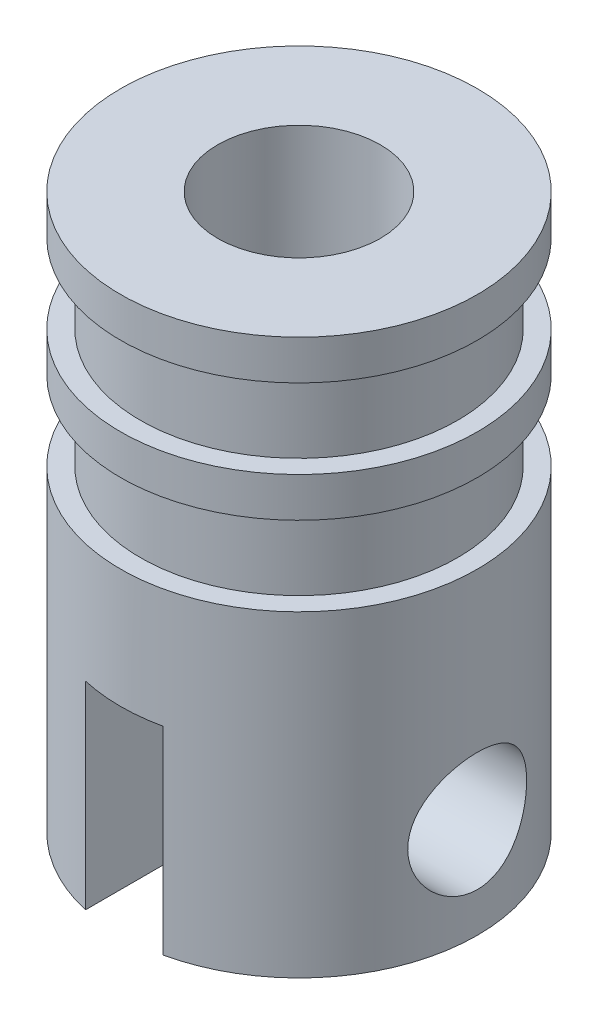
ISO-10303-21;
HEADER;
FILE_DESCRIPTION(('STEP AP214'),'2;1');
FILE_NAME('part.step','',(''),(''),'','','');
FILE_SCHEMA(('AUTOMOTIVE_DESIGN { 1 0 10303 214 1 1 1 1 }'));
ENDSEC;
DATA;
#1=APPLICATION_CONTEXT('core data for automotive mechanical design processes');
#2=APPLICATION_PROTOCOL_DEFINITION('international standard','automotive_design',2000,#1);
#3=PRODUCT_CONTEXT('',#1,'mechanical');
#4=PRODUCT('Part','Part','',(#3));
#5=PRODUCT_RELATED_PRODUCT_CATEGORY('part','',(#4));
#6=PRODUCT_DEFINITION_FORMATION('','',#4);
#7=PRODUCT_DEFINITION_CONTEXT('part definition',#1,'design');
#8=PRODUCT_DEFINITION('design','',#6,#7);
#9=PRODUCT_DEFINITION_SHAPE('','',#8);
#10=(LENGTH_UNIT() NAMED_UNIT(*) SI_UNIT(.MILLI.,.METRE.));
#11=(NAMED_UNIT(*) PLANE_ANGLE_UNIT() SI_UNIT($,.RADIAN.));
#12=(NAMED_UNIT(*) SI_UNIT($,.STERADIAN.) SOLID_ANGLE_UNIT());
#13=UNCERTAINTY_MEASURE_WITH_UNIT(LENGTH_MEASURE(1.E-05),#10,'distance_accuracy_value','');
#14=(GEOMETRIC_REPRESENTATION_CONTEXT(3) GLOBAL_UNCERTAINTY_ASSIGNED_CONTEXT((#13)) GLOBAL_UNIT_ASSIGNED_CONTEXT((#10,
#11,#12)) REPRESENTATION_CONTEXT('',''));
#15=CARTESIAN_POINT('',(0.,0.,0.));
#16=DIRECTION('',(0.,0.,1.));
#17=DIRECTION('',(1.,0.,0.));
#18=AXIS2_PLACEMENT_3D('',#15,#16,#17);
#19=CARTESIAN_POINT('',(-0.0120862167212276,-8.34923280183636,-1.91380127253106E-05));
#20=DIRECTION('',(0.,-1.,0.));
#21=DIRECTION('',(0.,0.,-1.));
#22=AXIS2_PLACEMENT_3D('',#19,#20,#21);
#23=PLANE('',#22);
#24=CARTESIAN_POINT('',(-0.0120862167212276,-8.34923280183638,-1.91380127253106E-05));
#25=DIRECTION('',(0.,1.,0.));
#26=DIRECTION('',(0.,0.,1.));
#27=AXIS2_PLACEMENT_3D('',#24,#25,#26);
#28=CIRCLE('',#27,14.35);
#29=CARTESIAN_POINT('',(-7.01208621672123,-8.34923280183636,12.5268519797086));
#30=VERTEX_POINT('',#29);
#31=CARTESIAN_POINT('',(6.75846371262122,-8.34923280183638,12.6523384942344));
#32=VERTEX_POINT('',#31);
#33=EDGE_CURVE('E113',#30,#32,#28,.T.);
#34=ORIENTED_EDGE('',*,*,#33,.T.);
#35=DIRECTION('',(0.,0.,1.));
#36=VECTOR('',#35,1.);
#37=CARTESIAN_POINT('',(6.75846371262122,-8.34923280183636,-31.5000191380127));
#38=LINE('',#37,#36);
#39=CARTESIAN_POINT('',(6.75846371262122,-8.34923280183636,30.7637526342242));
#40=VERTEX_POINT('',#39);
#41=EDGE_CURVE('E121',#32,#40,#38,.T.);
#42=ORIENTED_EDGE('',*,*,#41,.T.);
#43=CARTESIAN_POINT('',(-0.0120862167212276,-8.34923280183636,-1.91380127253106E-05));
#44=DIRECTION('',(0.,-1.,0.));
#45=DIRECTION('',(0.,0.,-1.));
#46=AXIS2_PLACEMENT_3D('',#43,#44,#45);
#47=CIRCLE('',#46,31.5);
#48=CARTESIAN_POINT('',(-7.01208621672123,-8.34923280183636,30.7123562178597));
#49=VERTEX_POINT('',#48);
#50=EDGE_CURVE('E11',#40,#49,#47,.T.);
#51=ORIENTED_EDGE('',*,*,#50,.T.);
#52=DIRECTION('',(0.,0.,-1.));
#53=VECTOR('',#52,1.);
#54=CARTESIAN_POINT('',(-7.01208621672123,-8.34923280183636,31.4999808619873));
#55=LINE('',#54,#53);
#56=EDGE_CURVE('E123',#49,#30,#55,.T.);
#57=ORIENTED_EDGE('',*,*,#56,.T.);
#58=EDGE_LOOP('',(#34,#42,#51,#57));
#59=FACE_BOUND('',#58,.T.);
#60=ADVANCED_FACE('F43',(#59),#23,.T.);
#61=CARTESIAN_POINT('',(-31.5120862167212,-43.3492328018364,-1.91380127253106E-05));
#62=DIRECTION('',(0.,1.,0.));
#63=DIRECTION('',(0.,0.,1.));
#64=AXIS2_PLACEMENT_3D('',#61,#62,#63);
#65=PLANE('',#64);
#66=CARTESIAN_POINT('',(-0.0120862167212276,-43.3492328018364,-1.91380127253106E-05));
#67=DIRECTION('',(0.,-1.,0.));
#68=DIRECTION('',(0.,0.,-1.));
#69=AXIS2_PLACEMENT_3D('',#66,#67,#68);
#70=CIRCLE('',#69,31.5);
#71=CARTESIAN_POINT('',(6.75846371262122,-43.3492328018364,-30.7637909102496));
#72=VERTEX_POINT('',#71);
#73=CARTESIAN_POINT('',(6.75846371262122,-43.3492328018364,30.7637526342242));
#74=VERTEX_POINT('',#73);
#75=EDGE_CURVE('E154',#72,#74,#70,.T.);
#76=ORIENTED_EDGE('',*,*,#75,.T.);
#77=DIRECTION('',(0.,0.,-1.));
#78=VECTOR('',#77,1.);
#79=CARTESIAN_POINT('',(6.75846371262122,-43.3492328018364,-1.91380127253106E-05));
#80=LINE('',#79,#78);
#81=EDGE_CURVE('E194',#74,#72,#80,.T.);
#82=ORIENTED_EDGE('',*,*,#81,.T.);
#83=EDGE_LOOP('',(#76,#82));
#84=FACE_BOUND('',#83,.T.);
#85=ADVANCED_FACE('F210',(#84),#65,.F.);
#86=CARTESIAN_POINT('',(-0.0120862167212276,54.6507671981636,-1.91380127253106E-05));
#87=DIRECTION('',(0.,-1.,0.));
#88=DIRECTION('',(0.,0.,-1.));
#89=AXIS2_PLACEMENT_3D('',#86,#87,#88);
#90=PLANE('',#89);
#91=CARTESIAN_POINT('',(-0.0120862167212276,54.6507671981636,-1.91380127253106E-05));
#92=DIRECTION('',(0.,1.,0.));
#93=DIRECTION('',(0.,0.,1.));
#94=AXIS2_PLACEMENT_3D('',#91,#92,#93);
#95=CIRCLE('',#94,14.35);
#96=CARTESIAN_POINT('',(-0.0120862167212276,54.6507671981636,14.3499808619873));
#97=VERTEX_POINT('',#96);
#98=EDGE_CURVE('E125',#97,#97,#95,.T.);
#99=ORIENTED_EDGE('',*,*,#98,.F.);
#100=EDGE_LOOP('',(#99));
#101=FACE_BOUND('',#100,.T.);
#102=CARTESIAN_POINT('',(-0.0120862167212276,54.6507671981636,-1.91380127253106E-05));
#103=DIRECTION('',(0.,-1.,0.));
#104=DIRECTION('',(0.,0.,-1.));
#105=AXIS2_PLACEMENT_3D('',#102,#103,#104);
#106=CIRCLE('',#105,31.5);
#107=CARTESIAN_POINT('',(-0.0120862167212276,54.6507671981636,-31.5000191380127));
#108=VERTEX_POINT('',#107);
#109=EDGE_CURVE('E187',#108,#108,#106,.T.);
#110=ORIENTED_EDGE('',*,*,#109,.F.);
#111=EDGE_LOOP('',(#110));
#112=FACE_BOUND('',#111,.T.);
#113=ADVANCED_FACE('F45',(#101,#112),#90,.F.);
#114=CARTESIAN_POINT('',(-0.0120862167212276,-43.3492328018364,-1.91380127253106E-05));
#115=DIRECTION('',(0.,-1.,0.));
#116=DIRECTION('',(0.,0.,-1.));
#117=AXIS2_PLACEMENT_3D('',#114,#115,#116);
#118=CYLINDRICAL_SURFACE('',#117,31.5);
#119=CARTESIAN_POINT('',(-0.0120862167212276,47.6507671981636,-1.91380127253106E-05));
#120=DIRECTION('',(0.,-1.,0.));
#121=DIRECTION('',(0.,0.,-1.));
#122=AXIS2_PLACEMENT_3D('',#119,#120,#121);
#123=CIRCLE('',#122,31.5);
#124=CARTESIAN_POINT('',(-0.0120862167212276,47.6507671981636,-31.5000191380127));
#125=VERTEX_POINT('',#124);
#126=EDGE_CURVE('E183',#125,#125,#123,.T.);
#127=ORIENTED_EDGE('',*,*,#126,.F.);
#128=EDGE_LOOP('',(#127));
#129=FACE_BOUND('',#128,.T.);
#130=ORIENTED_EDGE('',*,*,#109,.T.);
#131=EDGE_LOOP('',(#130));
#132=FACE_BOUND('',#131,.T.);
#133=ADVANCED_FACE('F218',(#129,#132),#118,.T.);
#134=CARTESIAN_POINT('',(-31.5120862167212,47.6507671981636,-1.91380127253106E-05));
#135=DIRECTION('',(0.,1.,0.));
#136=DIRECTION('',(0.,0.,1.));
#137=AXIS2_PLACEMENT_3D('',#134,#135,#136);
#138=PLANE('',#137);
#139=CARTESIAN_POINT('',(-0.0120862167212276,47.6507671981636,-1.91380127253106E-05));
#140=DIRECTION('',(0.,-1.,0.));
#141=DIRECTION('',(0.,0.,-1.));
#142=AXIS2_PLACEMENT_3D('',#139,#140,#141);
#143=CIRCLE('',#142,28.);
#144=CARTESIAN_POINT('',(-0.0120862167212276,47.6507671981636,-28.0000191380127));
#145=VERTEX_POINT('',#144);
#146=EDGE_CURVE('E179',#145,#145,#143,.T.);
#147=ORIENTED_EDGE('',*,*,#146,.F.);
#148=EDGE_LOOP('',(#147));
#149=FACE_BOUND('',#148,.T.);
#150=ORIENTED_EDGE('',*,*,#126,.T.);
#151=EDGE_LOOP('',(#150));
#152=FACE_BOUND('',#151,.T.);
#153=ADVANCED_FACE('F401',(#149,#152),#138,.F.);
#154=CARTESIAN_POINT('',(-0.0120862167212276,-43.3492328018364,-1.91380127253106E-05));
#155=DIRECTION('',(0.,-1.,0.));
#156=DIRECTION('',(0.,0.,-1.));
#157=AXIS2_PLACEMENT_3D('',#154,#155,#156);
#158=CYLINDRICAL_SURFACE('',#157,28.);
#159=CARTESIAN_POINT('',(-0.0120862167212276,33.6507671981636,-1.91380127253106E-05));
#160=DIRECTION('',(0.,-1.,0.));
#161=DIRECTION('',(0.,0.,-1.));
#162=AXIS2_PLACEMENT_3D('',#159,#160,#161);
#163=CIRCLE('',#162,28.);
#164=CARTESIAN_POINT('',(-0.0120862167212276,33.6507671981636,-28.0000191380127));
#165=VERTEX_POINT('',#164);
#166=EDGE_CURVE('E175',#165,#165,#163,.T.);
#167=ORIENTED_EDGE('',*,*,#166,.F.);
#168=EDGE_LOOP('',(#167));
#169=FACE_BOUND('',#168,.T.);
#170=ORIENTED_EDGE('',*,*,#146,.T.);
#171=EDGE_LOOP('',(#170));
#172=FACE_BOUND('',#171,.T.);
#173=ADVANCED_FACE('F392',(#169,#172),#158,.T.);
#174=CARTESIAN_POINT('',(-28.0120862167212,33.6507671981636,-1.91380127253106E-05));
#175=DIRECTION('',(0.,-1.,0.));
#176=DIRECTION('',(0.,0.,-1.));
#177=AXIS2_PLACEMENT_3D('',#174,#175,#176);
#178=PLANE('',#177);
#179=CARTESIAN_POINT('',(-0.0120862167212276,33.6507671981636,-1.91380127253106E-05));
#180=DIRECTION('',(0.,-1.,0.));
#181=DIRECTION('',(0.,0.,-1.));
#182=AXIS2_PLACEMENT_3D('',#179,#180,#181);
#183=CIRCLE('',#182,31.5);
#184=CARTESIAN_POINT('',(-0.0120862167212276,33.6507671981636,-31.5000191380127));
#185=VERTEX_POINT('',#184);
#186=EDGE_CURVE('E171',#185,#185,#183,.T.);
#187=ORIENTED_EDGE('',*,*,#186,.F.);
#188=EDGE_LOOP('',(#187));
#189=FACE_BOUND('',#188,.T.);
#190=ORIENTED_EDGE('',*,*,#166,.T.);
#191=EDGE_LOOP('',(#190));
#192=FACE_BOUND('',#191,.T.);
#193=ADVANCED_FACE('F383',(#189,#192),#178,.F.);
#194=CARTESIAN_POINT('',(-0.0120862167212276,-43.3492328018364,-1.91380127253106E-05));
#195=DIRECTION('',(0.,-1.,0.));
#196=DIRECTION('',(0.,0.,-1.));
#197=AXIS2_PLACEMENT_3D('',#194,#195,#196);
#198=CYLINDRICAL_SURFACE('',#197,31.5);
#199=CARTESIAN_POINT('',(-0.0120862167212276,26.6507671981636,-1.91380127253106E-05));
#200=DIRECTION('',(0.,-1.,0.));
#201=DIRECTION('',(0.,0.,-1.));
#202=AXIS2_PLACEMENT_3D('',#199,#200,#201);
#203=CIRCLE('',#202,31.5);
#204=CARTESIAN_POINT('',(-0.0120862167212276,26.6507671981636,-31.5000191380127));
#205=VERTEX_POINT('',#204);
#206=EDGE_CURVE('E167',#205,#205,#203,.T.);
#207=ORIENTED_EDGE('',*,*,#206,.F.);
#208=EDGE_LOOP('',(#207));
#209=FACE_BOUND('',#208,.T.);
#210=ORIENTED_EDGE('',*,*,#186,.T.);
#211=EDGE_LOOP('',(#210));
#212=FACE_BOUND('',#211,.T.);
#213=ADVANCED_FACE('F374',(#209,#212),#198,.T.);
#214=CARTESIAN_POINT('',(-31.5120862167212,26.6507671981636,-1.91380127253106E-05));
#215=DIRECTION('',(0.,1.,0.));
#216=DIRECTION('',(0.,0.,1.));
#217=AXIS2_PLACEMENT_3D('',#214,#215,#216);
#218=PLANE('',#217);
#219=CARTESIAN_POINT('',(-0.0120862167212276,26.6507671981636,-1.91380127253106E-05));
#220=DIRECTION('',(0.,-1.,0.));
#221=DIRECTION('',(0.,0.,-1.));
#222=AXIS2_PLACEMENT_3D('',#219,#220,#221);
#223=CIRCLE('',#222,28.);
#224=CARTESIAN_POINT('',(-0.0120862167212276,26.6507671981636,-28.0000191380127));
#225=VERTEX_POINT('',#224);
#226=EDGE_CURVE('E163',#225,#225,#223,.T.);
#227=ORIENTED_EDGE('',*,*,#226,.F.);
#228=EDGE_LOOP('',(#227));
#229=FACE_BOUND('',#228,.T.);
#230=ORIENTED_EDGE('',*,*,#206,.T.);
#231=EDGE_LOOP('',(#230));
#232=FACE_BOUND('',#231,.T.);
#233=ADVANCED_FACE('F365',(#229,#232),#218,.F.);
#234=CARTESIAN_POINT('',(-0.0120862167212276,-43.3492328018364,-1.91380127253106E-05));
#235=DIRECTION('',(0.,-1.,0.));
#236=DIRECTION('',(0.,0.,-1.));
#237=AXIS2_PLACEMENT_3D('',#234,#235,#236);
#238=CYLINDRICAL_SURFACE('',#237,28.);
#239=CARTESIAN_POINT('',(-0.0120862167212276,12.6507671981636,-1.91380127253106E-05));
#240=DIRECTION('',(0.,-1.,0.));
#241=DIRECTION('',(0.,0.,-1.));
#242=AXIS2_PLACEMENT_3D('',#239,#240,#241);
#243=CIRCLE('',#242,28.);
#244=CARTESIAN_POINT('',(-0.0120862167212276,12.6507671981636,-28.0000191380127));
#245=VERTEX_POINT('',#244);
#246=EDGE_CURVE('E159',#245,#245,#243,.T.);
#247=ORIENTED_EDGE('',*,*,#246,.F.);
#248=EDGE_LOOP('',(#247));
#249=FACE_BOUND('',#248,.T.);
#250=ORIENTED_EDGE('',*,*,#226,.T.);
#251=EDGE_LOOP('',(#250));
#252=FACE_BOUND('',#251,.T.);
#253=ADVANCED_FACE('F357',(#249,#252),#238,.T.);
#254=CARTESIAN_POINT('',(-28.0120862167212,12.6507671981636,-1.91380127253106E-05));
#255=DIRECTION('',(0.,-1.,0.));
#256=DIRECTION('',(0.,0.,-1.));
#257=AXIS2_PLACEMENT_3D('',#254,#255,#256);
#258=PLANE('',#257);
#259=CARTESIAN_POINT('',(-0.0120862167212276,12.6507671981636,-1.91380127253106E-05));
#260=DIRECTION('',(0.,-1.,0.));
#261=DIRECTION('',(0.,0.,-1.));
#262=AXIS2_PLACEMENT_3D('',#259,#260,#261);
#263=CIRCLE('',#262,31.5);
#264=CARTESIAN_POINT('',(-0.0120862167212276,12.6507671981636,-31.5000191380127));
#265=VERTEX_POINT('',#264);
#266=EDGE_CURVE('E155',#265,#265,#263,.T.);
#267=ORIENTED_EDGE('',*,*,#266,.F.);
#268=EDGE_LOOP('',(#267));
#269=FACE_BOUND('',#268,.T.);
#270=ORIENTED_EDGE('',*,*,#246,.T.);
#271=EDGE_LOOP('',(#270));
#272=FACE_BOUND('',#271,.T.);
#273=ADVANCED_FACE('F229',(#269,#272),#258,.F.);
#274=CARTESIAN_POINT('',(-0.0120862167212276,-43.3492328018364,-1.91380127253106E-05));
#275=DIRECTION('',(0.,-1.,0.));
#276=DIRECTION('',(0.,0.,-1.));
#277=AXIS2_PLACEMENT_3D('',#274,#275,#276);
#278=CYLINDRICAL_SURFACE('',#277,31.5);
#279=CARTESIAN_POINT('',(31.4879137832788,-36.3492328018364,-1.91380127253106E-05));
#280=CARTESIAN_POINT('',(31.4879138597161,-36.3492329178277,0.286439154935717));
#281=CARTESIAN_POINT('',(31.4839972979168,-36.3375007868215,0.572895740631813));
#282=CARTESIAN_POINT('',(31.4684389420299,-36.2906862674866,1.14367892714215));
#283=CARTESIAN_POINT('',(31.4567972107239,-36.2556040689214,1.4280055452474));
#284=CARTESIAN_POINT('',(31.4261052190651,-36.162419151116,1.99247254116304));
#285=CARTESIAN_POINT('',(31.4070543831065,-36.1043146432897,2.27261259196697));
#286=CARTESIAN_POINT('',(31.3620581594448,-35.9656172325042,2.82669829870414));
#287=CARTESIAN_POINT('',(31.3361127249198,-35.8850241768229,3.10064391255664));
#288=CARTESIAN_POINT('',(31.2780715906747,-35.7022256096122,3.6399605115064));
#289=CARTESIAN_POINT('',(31.2459876740785,-35.6000614665695,3.90534680422508));
#290=CARTESIAN_POINT('',(31.1764584185749,-35.3748188799899,4.42647153601744));
#291=CARTESIAN_POINT('',(31.1390110961711,-35.2517326958979,4.68220636137708));
#292=CARTESIAN_POINT('',(31.0597224317063,-34.9856116830419,5.18233714585048));
#293=CARTESIAN_POINT('',(31.0178813450973,-34.8425780138606,5.42673376297458));
#294=CARTESIAN_POINT('',(30.9308539021926,-34.5375528507859,5.90277841985671));
#295=CARTESIAN_POINT('',(30.8856673448502,-34.3755602172104,6.13442569198023));
#296=CARTESIAN_POINT('',(30.7916308547132,-34.02833876279,6.59065187331497));
#297=CARTESIAN_POINT('',(30.7427106062667,-33.8425425892427,6.81478463392311));
#298=CARTESIAN_POINT('',(30.6438051842065,-33.4531223827029,7.24673361365516));
#299=CARTESIAN_POINT('',(30.5938199928422,-33.2494980523707,7.45454956053613));
#300=CARTESIAN_POINT('',(30.4941046148841,-32.8256293602066,7.85265212486547));
#301=CARTESIAN_POINT('',(30.4443744890235,-32.605381219967,8.04293473522293));
#302=CARTESIAN_POINT('',(30.3465295060643,-32.1496352682898,8.40471615769755));
#303=CARTESIAN_POINT('',(30.2984146077,-31.9141378468911,8.57621544994383));
#304=CARTESIAN_POINT('',(30.2037790865774,-31.4222418038725,8.9039930654801));
#305=CARTESIAN_POINT('',(30.1573454171757,-31.1654346811092,9.05968428803724));
#306=CARTESIAN_POINT('',(30.0690341575906,-30.6389211508618,9.34872611337157));
#307=CARTESIAN_POINT('',(30.0271547716881,-30.3692198882671,9.48208553268682));
#308=CARTESIAN_POINT('',(29.9492562991265,-29.8186521052773,9.72542624713692));
#309=CARTESIAN_POINT('',(29.9132370450332,-29.5377859041694,9.83540821023374));
#310=CARTESIAN_POINT('',(29.8482459475442,-28.9668970569157,10.030992683474));
#311=CARTESIAN_POINT('',(29.8192737869832,-28.6768748235151,10.1165962908318));
#312=CARTESIAN_POINT('',(29.7702078822045,-28.0997649190892,10.260123052261));
#313=CARTESIAN_POINT('',(29.7498478849886,-27.8129076177615,10.3188816721597));
#314=CARTESIAN_POINT('',(29.7173036594783,-27.2348308383749,10.4122732485438));
#315=CARTESIAN_POINT('',(29.7051192613727,-26.9436114510471,10.4469067061211));
#316=CARTESIAN_POINT('',(29.6893395398497,-26.3591414734951,10.4916858756131));
#317=CARTESIAN_POINT('',(29.6857419216941,-26.0658914469548,10.501838129912));
#318=CARTESIAN_POINT('',(29.6872522600573,-25.4795973539151,10.4975663985311));
#319=CARTESIAN_POINT('',(29.6923599709296,-25.1865532818375,10.4831431063226));
#320=CARTESIAN_POINT('',(29.7106752551526,-24.6163422868081,10.4310958702668));
#321=CARTESIAN_POINT('',(29.7235013998791,-24.3390625598899,10.3945640292334));
#322=CARTESIAN_POINT('',(29.7565249002452,-23.7887354702475,10.2996078289675));
#323=CARTESIAN_POINT('',(29.7767219976116,-23.5156879595785,10.2411842368055));
#324=CARTESIAN_POINT('',(29.8238804212341,-22.9756886123929,10.1029713472297));
#325=CARTESIAN_POINT('',(29.8508411099408,-22.7087362039262,10.0231840635514));
#326=CARTESIAN_POINT('',(29.9107553631392,-22.1825153034098,9.84287532103765));
#327=CARTESIAN_POINT('',(29.9437112035376,-21.9232497731069,9.74234598605887));
#328=CARTESIAN_POINT('',(30.0152427622858,-21.4100817231511,9.51961330930336));
#329=CARTESIAN_POINT('',(30.0538986675756,-21.1563275393715,9.39709414950211));
#330=CARTESIAN_POINT('',(30.1353691775714,-20.6599120907532,9.13234705502809));
#331=CARTESIAN_POINT('',(30.1781852016801,-20.4172546538684,8.99011238645385));
#332=CARTESIAN_POINT('',(30.2668178617031,-19.9444924988979,8.6869196481169));
#333=CARTESIAN_POINT('',(30.3126347044758,-19.7143886481887,8.52596028699245));
#334=CARTESIAN_POINT('',(30.4060762786238,-19.2680286009317,8.18633563197464));
#335=CARTESIAN_POINT('',(30.4537010721081,-19.0517728807994,8.00766972946342));
#336=CARTESIAN_POINT('',(30.5520676276869,-18.6233611331625,7.62387497453428));
#337=CARTESIAN_POINT('',(30.6028418844649,-18.4120146894452,7.4178497560302));
#338=CARTESIAN_POINT('',(30.7036438715618,-18.0073922407779,6.98872038422335));
#339=CARTESIAN_POINT('',(30.7536718320883,-17.8141105623539,6.76562163339297));
#340=CARTESIAN_POINT('',(30.8516600628083,-17.4467212771494,6.30354803336617));
#341=CARTESIAN_POINT('',(30.8996193377963,-17.2726228378152,6.06456568028896));
#342=CARTESIAN_POINT('',(30.9921194506424,-16.9449943187265,5.57240328711504));
#343=CARTESIAN_POINT('',(31.036661638086,-16.7914561006226,5.3192289212715));
#344=CARTESIAN_POINT('',(31.1215561449416,-16.5045733835108,4.79756797165589));
#345=CARTESIAN_POINT('',(31.1618611996043,-16.3714503492415,4.52895175478584));
#346=CARTESIAN_POINT('',(31.2366107440206,-16.1284077261297,3.98062035828215));
#347=CARTESIAN_POINT('',(31.2710551587431,-16.0184884343498,3.70090503660821));
#348=CARTESIAN_POINT('',(31.3330765256151,-15.8228757553461,3.13246897206295));
#349=CARTESIAN_POINT('',(31.3606554119703,-15.7371755440278,2.84375079139327));
#350=CARTESIAN_POINT('',(31.4081431566557,-15.5907916056177,2.25942489395074));
#351=CARTESIAN_POINT('',(31.4280523679959,-15.5301067271435,1.96381749493023));
#352=CARTESIAN_POINT('',(31.4589211589745,-15.4364440969669,1.38097309078101));
#353=CARTESIAN_POINT('',(31.4702314018838,-15.4023789381173,1.0939290054232));
#354=CARTESIAN_POINT('',(31.484975114308,-15.3580310518797,0.51781034559483));
#355=CARTESIAN_POINT('',(31.4884088117765,-15.3477476362289,0.228735830129428));
#356=CARTESIAN_POINT('',(31.4873036265328,-15.3510633547058,-0.349215572327094));
#357=CARTESIAN_POINT('',(31.4827659448781,-15.3646588909621,-0.638092482531193));
#358=CARTESIAN_POINT('',(31.4658470732599,-15.4155919817456,-1.21351066389073));
#359=CARTESIAN_POINT('',(31.4534659625045,-15.4529292965128,-1.50005195860314));
#360=CARTESIAN_POINT('',(31.421673601107,-15.5495595956629,-2.06041011466112));
#361=CARTESIAN_POINT('',(31.4024768492911,-15.6081838041693,-2.33435489643659));
#362=CARTESIAN_POINT('',(31.3575110736569,-15.746958775548,-2.87617360057973));
#363=CARTESIAN_POINT('',(31.3317422117642,-15.8271090080579,-3.14404767234242));
#364=CARTESIAN_POINT('',(31.2742900288864,-16.0082617339141,-3.67196173906437));
#365=CARTESIAN_POINT('',(31.2426072361166,-16.1092623650477,-3.93200243127145));
#366=CARTESIAN_POINT('',(31.1741047725962,-16.3313723660939,-4.44275674157481));
#367=CARTESIAN_POINT('',(31.1372831597769,-16.4524893417033,-4.69346678783636));
#368=CARTESIAN_POINT('',(31.0584058407055,-16.7173182653733,-5.1903402422577));
#369=CARTESIAN_POINT('',(31.0162391539226,-16.8615347548326,-5.43621709217623));
#370=CARTESIAN_POINT('',(30.9285200304435,-17.169206438254,-5.91509926893022));
#371=CARTESIAN_POINT('',(30.8829664282587,-17.3326682662242,-6.14810011640749));
#372=CARTESIAN_POINT('',(30.7896325485125,-17.6777296712155,-6.59981631911763));
#373=CARTESIAN_POINT('',(30.7418520645327,-17.8593309314411,-6.81853034551935));
#374=CARTESIAN_POINT('',(30.6452725520462,-18.2395383516619,-7.24040527829436));
#375=CARTESIAN_POINT('',(30.5964734896295,-18.4381450784775,-7.44356566581112));
#376=CARTESIAN_POINT('',(30.4968710235878,-18.8606343903392,-7.84206081756099));
#377=CARTESIAN_POINT('',(30.446077875213,-19.0852571118332,-8.03661432655542));
#378=CARTESIAN_POINT('',(30.3461843104588,-19.5503328594134,-8.40609040659345));
#379=CARTESIAN_POINT('',(30.297083337932,-19.7907806074017,-8.58101947083023));
#380=CARTESIAN_POINT('',(30.2019572106101,-20.2861829571344,-8.9101791545323));
#381=CARTESIAN_POINT('',(30.1559333529634,-20.5411435939386,-9.06440107223937));
#382=CARTESIAN_POINT('',(30.068382123022,-21.0637450724381,-9.35084028791372));
#383=CARTESIAN_POINT('',(30.0268528797139,-21.3313805706366,-9.48306675453021));
#384=CARTESIAN_POINT('',(29.949630873442,-21.8771649441549,-9.72429453076567));
#385=CARTESIAN_POINT('',(29.913927873604,-22.1552942989617,-9.83333668030038));
#386=CARTESIAN_POINT('',(29.8494230398737,-22.7205656473821,-10.0275185991761));
#387=CARTESIAN_POINT('',(29.8206212292625,-23.0077076713961,-10.1126582878825));
#388=CARTESIAN_POINT('',(29.7708955825161,-23.5887579122186,-10.2581825204459));
#389=CARTESIAN_POINT('',(29.7499687755411,-23.8826635329731,-10.3185764004074));
#390=CARTESIAN_POINT('',(29.7167043848932,-24.4750372681539,-10.4140278175198));
#391=CARTESIAN_POINT('',(29.7043663683633,-24.7735051518769,-10.449086631508));
#392=CARTESIAN_POINT('',(29.6891163183948,-25.3571675046783,-10.4923523298079));
#393=CARTESIAN_POINT('',(29.6857522651577,-25.6422554291617,-10.5018471236192));
#394=CARTESIAN_POINT('',(29.6872498341811,-26.2122309218816,-10.4976115617145));
#395=CARTESIAN_POINT('',(29.6921111609079,-26.4971184969486,-10.483882040436));
#396=CARTESIAN_POINT('',(29.709902268799,-27.0645610613435,-10.4333365847448));
#397=CARTESIAN_POINT('',(29.7228315472273,-27.3471161949008,-10.396522088819));
#398=CARTESIAN_POINT('',(29.756346853233,-27.9078589977308,-10.3001642139683));
#399=CARTESIAN_POINT('',(29.7769329052905,-28.1860466530371,-10.2406207623747));
#400=CARTESIAN_POINT('',(29.8246569371794,-28.7308051013665,-10.1007172647222));
#401=CARTESIAN_POINT('',(29.8516612130282,-28.9974964270086,-10.0207798483564));
#402=CARTESIAN_POINT('',(29.9116453312365,-29.5231860094879,-9.84020899649635));
#403=CARTESIAN_POINT('',(29.9446272936369,-29.7821814988731,-9.73956821665024));
#404=CARTESIAN_POINT('',(30.0156354582603,-30.2907968853841,-9.51839143447972));
#405=CARTESIAN_POINT('',(30.0536614873845,-30.5404171038668,-9.3978561148475));
#406=CARTESIAN_POINT('',(30.1337351471366,-31.0288665823837,-9.1377412404664));
#407=CARTESIAN_POINT('',(30.1757830516179,-31.267695105968,-8.99816038861199));
#408=CARTESIAN_POINT('',(30.2647054657089,-31.7433884035208,-8.69438537063788));
#409=CARTESIAN_POINT('',(30.3117105136445,-31.9797129698323,-8.52938308259401));
#410=CARTESIAN_POINT('',(30.4076218636492,-32.437768975165,-8.18073069623537));
#411=CARTESIAN_POINT('',(30.4565282106474,-32.6595000689991,-7.99708015708469));
#412=CARTESIAN_POINT('',(30.5549519638353,-33.0871287342566,-7.61222173779385));
#413=CARTESIAN_POINT('',(30.604469532079,-33.2930219971838,-7.41100911164903));
#414=CARTESIAN_POINT('',(30.7028058257097,-33.687671459918,-6.99227573714024));
#415=CARTESIAN_POINT('',(30.7516245599249,-33.8764278763705,-6.77475519500581));
#416=CARTESIAN_POINT('',(30.8491790322909,-34.2426868333981,-6.31582967777433));
#417=CARTESIAN_POINT('',(30.8978362320779,-34.4194563858518,-6.07382221676633));
#418=CARTESIAN_POINT('',(30.9916499232677,-34.7518773236339,-5.57520228855611));
#419=CARTESIAN_POINT('',(31.0368077234242,-34.9075366205636,-5.31859534434546));
#420=CARTESIAN_POINT('',(31.1223700935945,-35.1966087664188,-4.79237521909222));
#421=CARTESIAN_POINT('',(31.1627746425208,-35.3300215166505,-4.52276198035582));
#422=CARTESIAN_POINT('',(31.237671602676,-35.573469918094,-3.97239152908948));
#423=CARTESIAN_POINT('',(31.2721643200486,-35.6835067798951,-3.69163489454726));
#424=CARTESIAN_POINT('',(31.3328469466591,-35.8748346612209,-3.1337614584132));
#425=CARTESIAN_POINT('',(31.3593389373279,-35.9571902689289,-2.85704238040376));
#426=CARTESIAN_POINT('',(31.405294030775,-36.098929515729,-2.29720934172652));
#427=CARTESIAN_POINT('',(31.4247573642536,-36.1583139088059,-2.01409559127409));
#428=CARTESIAN_POINT('',(31.4561152930354,-36.2535458599739,-1.44358670463469));
#429=CARTESIAN_POINT('',(31.4680116359119,-36.2893988526307,-1.15619257269124));
#430=CARTESIAN_POINT('',(31.4839108315259,-36.3372422320682,-0.579204754192704));
#431=CARTESIAN_POINT('',(31.4879137060053,-36.3492326845762,-0.289611073698307));
#432=CARTESIAN_POINT('',(31.4879137832788,-36.3492328018364,-1.91380127253106E-05));
#433=B_SPLINE_CURVE_WITH_KNOTS('',3,(#279,#280,#281,#282,#283,#284,#285,#286,#287,#288,#289,
#290,#291,#292,#293,#294,#295,#296,#297,#298,#299,#300,#301,#302,#303,#304,#305,#306,#307,#308,
#309,#310,#311,#312,#313,#314,#315,#316,#317,#318,#319,#320,#321,#322,#323,#324,#325,#326,#327,
#328,#329,#330,#331,#332,#333,#334,#335,#336,#337,#338,#339,#340,#341,#342,#343,#344,#345,#346,
#347,#348,#349,#350,#351,#352,#353,#354,#355,#356,#357,#358,#359,#360,#361,#362,#363,#364,#365,
#366,#367,#368,#369,#370,#371,#372,#373,#374,#375,#376,#377,#378,#379,#380,#381,#382,#383,#384,
#385,#386,#387,#388,#389,#390,#391,#392,#393,#394,#395,#396,#397,#398,#399,#400,#401,#402,#403,
#404,#405,#406,#407,#408,#409,#410,#411,#412,#413,#414,#415,#416,#417,#418,#419,#420,#421,#422,
#423,#424,#425,#426,#427,#428,#429,#430,#431,#432),.UNSPECIFIED.,.T.,.F.,(4,2,2,2,2,2,2,2,2,2,2,
2,2,2,2,2,2,2,2,2,2,2,2,2,2,2,2,2,2,2,2,2,2,2,2,2,2,2,2,2,2,2,2,2,2,2,2,2,2,2,2,2,2,2,2,2,2,2,2,
2,2,2,2,2,2,2,2,2,2,2,2,2,2,2,2,2,4),(0.,0.859106253607876,1.71820552544189,2.5773715531539,
3.43654341569546,4.29408230764211,5.15193915769874,6.00974615978856,6.86760475382318,
7.75223335684599,8.63687671659352,9.52172175498315,10.4065441701562,11.3170778046572,
12.2272511109706,13.1373984074866,14.0475047338631,14.9269465532218,15.8063701055754,
16.6855586137321,17.5647223134071,18.4036469151371,19.2425421243265,20.0813582873045,
20.9204935525307,21.7728175442069,22.6254333707842,23.4781080335167,24.3308120149697,
25.2282286953623,26.125362576595,27.0229233450301,27.9201277752487,28.8264650211061,
29.7328138695169,30.6389070851417,31.5449585912963,32.4117188946019,33.2784541128502,
34.1450587502304,35.0116546362123,35.8530955030198,36.694515640147,37.5358606599693,
38.3775245072524,39.2410172675903,40.1048085564634,40.9686800733434,41.8325803957172,
42.7359388922428,43.638997605012,44.5424346300278,45.4454941148229,46.3469494047381,
47.2484077356611,48.1495256503133,49.0505981472321,49.9053421727289,50.7600554883731,
51.6147155498244,52.4693783438046,53.3075945864861,54.1461086939973,54.9845940334116,
55.823136506821,56.6982609404401,57.5734060664085,58.4487884295298,59.3241597244517,
60.2339055388709,61.1433094552739,62.0527174060159,62.9620782489024,63.8308140995543,
64.6995214332488,65.5680280687384,66.4365323119954),.UNSPECIFIED.);
#434=CARTESIAN_POINT('',(31.4879137832788,-36.3492328018364,-1.91380127253106E-05));
#435=VERTEX_POINT('',#434);
#436=EDGE_CURVE('E240',#435,#435,#433,.T.);
#437=ORIENTED_EDGE('',*,*,#436,.T.);
#438=EDGE_LOOP('',(#437));
#439=FACE_BOUND('',#438,.T.);
#440=CARTESIAN_POINT('',(-29.7105710265562,-25.8492328018364,10.4999808619873));
#441=CARTESIAN_POINT('',(-29.7105709333076,-26.1351917752572,10.4999809817266));
#442=CARTESIAN_POINT('',(-29.7147123482898,-26.4211490082712,10.4882893733683));
#443=CARTESIAN_POINT('',(-29.7311432748179,-26.9909189666795,10.4416405042646));
#444=CARTESIAN_POINT('',(-29.7434327275682,-27.2747317075332,10.4066834114012));
#445=CARTESIAN_POINT('',(-29.7757675575968,-27.8381649001887,10.3138396206291));
#446=CARTESIAN_POINT('',(-29.7958139532673,-28.1177847965118,10.2559499119228));
#447=CARTESIAN_POINT('',(-29.8430335256717,-28.670816441544,10.1177821853447));
#448=CARTESIAN_POINT('',(-29.8702067636837,-28.9442281368516,10.0375039749713));
#449=CARTESIAN_POINT('',(-29.9307860269657,-29.482406036118,9.85546526605053));
#450=CARTESIAN_POINT('',(-29.964178236863,-29.7471899037087,9.75375231988181));
#451=CARTESIAN_POINT('',(-30.0362717123706,-30.2671559697093,9.52952175838937));
#452=CARTESIAN_POINT('',(-30.0749749473845,-30.5223345614074,9.40699642150829));
#453=CARTESIAN_POINT('',(-30.1565901642181,-31.0214412471651,9.14208568511862));
#454=CARTESIAN_POINT('',(-30.199501987542,-31.2653697643952,8.99970103342828));
#455=CARTESIAN_POINT('',(-30.2883744421644,-31.7405933936469,8.69603699617429));
#456=CARTESIAN_POINT('',(-30.3343352593986,-31.9718877336316,8.53475645782899));
#457=CARTESIAN_POINT('',(-30.4297652410942,-32.4285038183916,8.18827845931029));
#458=CARTESIAN_POINT('',(-30.4793010334977,-32.6533217050381,8.00243501173139));
#459=CARTESIAN_POINT('',(-30.5789932077036,-33.0866546735991,7.61277487411084));
#460=CARTESIAN_POINT('',(-30.6291496013231,-33.29516944452,7.40895784136805));
#461=CARTESIAN_POINT('',(-30.7287453020989,-33.6946503185187,6.98456105151644));
#462=CARTESIAN_POINT('',(-30.7781844826833,-33.8856133550923,6.76397837749611));
#463=CARTESIAN_POINT('',(-30.8750201070391,-34.2487156124327,6.30741767806017));
#464=CARTESIAN_POINT('',(-30.9224166117977,-34.4208553954332,6.07144011281255));
#465=CARTESIAN_POINT('',(-31.0151167524101,-34.7494240549666,5.5790915530332));
#466=CARTESIAN_POINT('',(-31.0603321298682,-34.9053183337206,5.32234668519197));
#467=CARTESIAN_POINT('',(-31.1459899964531,-35.194770579366,4.79592811926825));
#468=CARTESIAN_POINT('',(-31.186434367185,-35.3283373605752,4.52625957747176));
#469=CARTESIAN_POINT('',(-31.2614127321196,-35.5720854010934,3.97575138831014));
#470=CARTESIAN_POINT('',(-31.2959467232894,-35.6822666484024,3.69491173521284));
#471=CARTESIAN_POINT('',(-31.3580948492043,-35.8782358189342,3.1241035614635));
#472=CARTESIAN_POINT('',(-31.3857092802343,-35.9640247866175,2.83413543227726));
#473=CARTESIAN_POINT('',(-31.4323723214726,-36.107831172077,2.25749358785727));
#474=CARTESIAN_POINT('',(-31.4516855088156,-36.1667109121269,1.97105620896089));
#475=CARTESIAN_POINT('',(-31.4825584156211,-36.2604086517455,1.39385796618112));
#476=CARTESIAN_POINT('',(-31.4941182987846,-36.2952271593363,1.1030971937131));
#477=CARTESIAN_POINT('',(-31.5091532576535,-36.3404523548366,0.519539380742668));
#478=CARTESIAN_POINT('',(-31.5126301254831,-36.3508644540126,0.226742806049894));
#479=CARTESIAN_POINT('',(-31.5114042425106,-36.3471869496806,-0.358675842478175));
#480=CARTESIAN_POINT('',(-31.5067016810842,-36.3330979134399,-0.651297920196631));
#481=CARTESIAN_POINT('',(-31.4895964677327,-36.2815962913131,-1.22264334772807));
#482=CARTESIAN_POINT('',(-31.4775035401247,-36.2451216202217,-1.50146113734148));
#483=CARTESIAN_POINT('',(-31.4462135385948,-36.1500276932443,-2.05487906863159));
#484=CARTESIAN_POINT('',(-31.4270166841287,-36.0914091214304,-2.3294793403237));
#485=CARTESIAN_POINT('',(-31.3820163332313,-35.9525404654374,-2.87260483063122));
#486=CARTESIAN_POINT('',(-31.3562125913963,-35.8722895777499,-3.14112982318547));
#487=CARTESIAN_POINT('',(-31.2986580197172,-35.690826896808,-3.67034338081646));
#488=CARTESIAN_POINT('',(-31.2669070579431,-35.589614638552,-3.93103177190109));
#489=CARTESIAN_POINT('',(-31.1978112832804,-35.3655842039363,-4.44625175676252));
#490=CARTESIAN_POINT('',(-31.1603994735224,-35.2425036770911,-4.70066022306551));
#491=CARTESIAN_POINT('',(-31.0812244882923,-34.9765254893274,-5.19830351649263));
#492=CARTESIAN_POINT('',(-31.0394597094409,-34.8336205197832,-5.44153417849536));
#493=CARTESIAN_POINT('',(-30.952639999207,-34.5290464744713,-5.91526372503239));
#494=CARTESIAN_POINT('',(-30.9075856283166,-34.3673805924993,-6.14576476678336));
#495=CARTESIAN_POINT('',(-30.8152738639115,-34.026233551342,-6.59287685667445));
#496=CARTESIAN_POINT('',(-30.7680154623892,-33.8467441974124,-6.80948143956187));
#497=CARTESIAN_POINT('',(-30.6702283037414,-33.4622380612846,-7.23733385779155));
#498=CARTESIAN_POINT('',(-30.6196503809924,-33.2564169024487,-7.44784822729335));
#499=CARTESIAN_POINT('',(-30.5187791948907,-32.8278898683563,-7.85080351289893));
#500=CARTESIAN_POINT('',(-30.468485821975,-32.6051910455636,-8.04325190357631));
#501=CARTESIAN_POINT('',(-30.3695259150249,-32.1440619229147,-8.40904910996117));
#502=CARTESIAN_POINT('',(-30.320860342743,-31.9056225620817,-8.58238676864434));
#503=CARTESIAN_POINT('',(-30.2265908210264,-31.4146874856944,-8.90858435076095));
#504=CARTESIAN_POINT('',(-30.1809856612724,-31.162197399993,-9.06145239352608));
#505=CARTESIAN_POINT('',(-30.0935257249055,-30.6408887845701,-9.34773200934281));
#506=CARTESIAN_POINT('',(-30.0517350463857,-30.3718863495528,-9.48082871537751));
#507=CARTESIAN_POINT('',(-29.9739785902052,-29.8227517306354,-9.72376769795486));
#508=CARTESIAN_POINT('',(-29.9380129003103,-29.5426193791188,-9.8336096241227));
#509=CARTESIAN_POINT('',(-29.8730972839056,-28.9733183099944,-10.0290084032269));
#510=CARTESIAN_POINT('',(-29.8441449466265,-28.6841527361622,-10.1145736027806));
#511=CARTESIAN_POINT('',(-29.7942275334212,-28.0988823863025,-10.2606248642693));
#512=CARTESIAN_POINT('',(-29.7732620455714,-27.8027779689837,-10.321112219614));
#513=CARTESIAN_POINT('',(-29.740802381192,-27.219454940645,-10.4142282295985));
#514=CARTESIAN_POINT('',(-29.7289234693932,-26.9324383840602,-10.4479909392301));
#515=CARTESIAN_POINT('',(-29.7135055392834,-26.3563776325607,-10.4917413547248));
#516=CARTESIAN_POINT('',(-29.709966270387,-26.0673334988315,-10.5017297749464));
#517=CARTESIAN_POINT('',(-29.7113447017611,-25.4894755242461,-10.4978307197956));
#518=CARTESIAN_POINT('',(-29.716261028957,-25.2006616536174,-10.4839471209169));
#519=CARTESIAN_POINT('',(-29.7343853695053,-24.6254236718571,-10.4324529824885));
#520=CARTESIAN_POINT('',(-29.7475932809131,-24.3389995313877,-10.3948427346562));
#521=CARTESIAN_POINT('',(-29.7812739947656,-23.7805272795734,-10.2979792123546));
#522=CARTESIAN_POINT('',(-29.8014795429954,-23.5083247044279,-10.239520040357));
#523=CARTESIAN_POINT('',(-29.848620390447,-22.9698698110479,-10.101333602212));
#524=CARTESIAN_POINT('',(-29.8755580738745,-22.7036196373463,-10.0215988005582));
#525=CARTESIAN_POINT('',(-29.9353739172721,-22.1789367527331,-9.84155558534396));
#526=CARTESIAN_POINT('',(-29.9682506575519,-21.9205021907521,-9.74125208781459));
#527=CARTESIAN_POINT('',(-30.0390453853335,-21.4128502660795,-9.52079236762892));
#528=CARTESIAN_POINT('',(-30.0769653197191,-21.1636365107362,-9.40062847365855));
#529=CARTESIAN_POINT('',(-30.1580687525594,-20.6683243219025,-9.13726723677491));
#530=CARTESIAN_POINT('',(-30.201379840972,-20.422567486636,-8.99346672296657));
#531=CARTESIAN_POINT('',(-30.2910974072638,-19.9438247323254,-8.68661999259926));
#532=CARTESIAN_POINT('',(-30.3375052663644,-19.7108445974913,-8.52356516293937));
#533=CARTESIAN_POINT('',(-30.4321644805438,-19.2590922675489,-8.17930389561965));
#534=CARTESIAN_POINT('',(-30.4804159069261,-19.0403206228683,-7.9980967554414));
#535=CARTESIAN_POINT('',(-30.5775091398096,-18.6182390674493,-7.618632653611));
#536=CARTESIAN_POINT('',(-30.6263509599717,-18.4149295152804,-7.42037529678732));
#537=CARTESIAN_POINT('',(-30.7257298350847,-18.0155163007981,-6.99797632140645));
#538=CARTESIAN_POINT('',(-30.7762345844602,-17.8202371367513,-6.77304646677344));
#539=CARTESIAN_POINT('',(-30.8751066386156,-17.4493534895974,-6.30720843551867));
#540=CARTESIAN_POINT('',(-30.9234747078284,-17.2737419349841,-6.0663060517533));
#541=CARTESIAN_POINT('',(-31.016772369085,-16.9432964030304,-5.56986993263734));
#542=CARTESIAN_POINT('',(-31.061700601981,-16.7884706205428,-5.31433048289385));
#543=CARTESIAN_POINT('',(-31.14682339566,-16.500932555778,-4.79047996104682));
#544=CARTESIAN_POINT('',(-31.1870199464975,-16.3682109670885,-4.52217432530852));
#545=CARTESIAN_POINT('',(-31.2613232227076,-16.1266848509956,-3.97627034267781));
#546=CARTESIAN_POINT('',(-31.2954672615449,-16.0177327503235,-3.69874242477095));
#547=CARTESIAN_POINT('',(-31.3570055089198,-15.8236433610777,-3.13474277765455));
#548=CARTESIAN_POINT('',(-31.3843997098852,-15.7385060992204,-2.8482710384119));
#549=CARTESIAN_POINT('',(-31.4316350111673,-15.5928789709063,-2.26860518268435));
#550=CARTESIAN_POINT('',(-31.4514783677332,-15.5323817414412,-1.97541310209496));
#551=CARTESIAN_POINT('',(-31.4830364504193,-15.436607772357,-1.38450925529569));
#552=CARTESIAN_POINT('',(-31.4947515264875,-15.4013299469609,-1.08679768422816));
#553=CARTESIAN_POINT('',(-31.5093533700307,-15.3574151493541,-0.503304363724488));
#554=CARTESIAN_POINT('',(-31.5126294854523,-15.347603092126,-0.217620173118088));
#555=CARTESIAN_POINT('',(-31.5113961699855,-15.3513028496686,0.353574571996772));
#556=CARTESIAN_POINT('',(-31.5068869989608,-15.3648138859419,0.639085131982606));
#557=CARTESIAN_POINT('',(-31.4902070013803,-15.4150272251171,1.20780629768249));
#558=CARTESIAN_POINT('',(-31.4780367960454,-15.4517276476299,1.49101708799525));
#559=CARTESIAN_POINT('',(-31.4463652550823,-15.5479726315743,2.05311083447904));
#560=CARTESIAN_POINT('',(-31.4268639006484,-15.607517251605,2.33199377954654));
#561=CARTESIAN_POINT('',(-31.3814225741388,-15.7477682330541,2.87901808007934));
#562=CARTESIAN_POINT('',(-31.3555914850394,-15.8281179127943,3.1472601271839));
#563=CARTESIAN_POINT('',(-31.297987907571,-16.0097682417759,3.67599874387116));
#564=CARTESIAN_POINT('',(-31.2662133026252,-16.111076356003,3.93649251575328));
#565=CARTESIAN_POINT('',(-31.1975279842031,-16.3338244203241,4.44799313282083));
#566=CARTESIAN_POINT('',(-31.1606176335067,-16.4552629485577,4.69900064650738));
#567=CARTESIAN_POINT('',(-31.0825668250188,-16.7173974803183,5.19007340499817));
#568=CARTESIAN_POINT('',(-31.0414260935505,-16.8580947299484,5.43013794041459));
#569=CARTESIAN_POINT('',(-30.9543347762166,-17.1633292325107,5.90659157358818));
#570=CARTESIAN_POINT('',(-30.908262667163,-17.328555040868,6.14251748286499));
#571=CARTESIAN_POINT('',(-30.8138373115616,-17.6775691038698,6.59972569376072));
#572=CARTESIAN_POINT('',(-30.7654840192967,-17.8613577306148,6.82100770168851));
#573=CARTESIAN_POINT('',(-30.6677302864156,-18.2463919283208,7.24769868337205));
#574=CARTESIAN_POINT('',(-30.6183295332218,-18.4476427672771,7.45310283151427));
#575=CARTESIAN_POINT('',(-30.5197813380826,-18.8663356581143,7.84674544817735));
#576=CARTESIAN_POINT('',(-30.4706338939782,-19.083777571753,8.03498406323));
#577=CARTESIAN_POINT('',(-30.3719818333392,-19.5424610384352,8.40021448439554));
#578=CARTESIAN_POINT('',(-30.3225395546333,-19.784302968529,8.57647009258343));
#579=CARTESIAN_POINT('',(-30.2267996512144,-20.2824898045053,8.90789002464409));
#580=CARTESIAN_POINT('',(-30.1805008570521,-20.5388292511973,9.0630622137871));
#581=CARTESIAN_POINT('',(-30.0924302403859,-21.0644434096761,9.35121675106411));
#582=CARTESIAN_POINT('',(-30.050658421372,-21.3337181314352,9.48419908209089));
#583=CARTESIAN_POINT('',(-29.9729606246752,-21.8833800224138,9.72686376030954));
#584=CARTESIAN_POINT('',(-29.9370343336242,-22.1637665949446,9.83654735660017));
#585=CARTESIAN_POINT('',(-29.8736702235055,-22.7207730425243,10.0272155600465));
#586=CARTESIAN_POINT('',(-29.8459221731416,-22.9969905321771,10.1092730986752));
#587=CARTESIAN_POINT('',(-29.797689979957,-23.5558368716186,10.250511991838));
#588=CARTESIAN_POINT('',(-29.7772055848664,-23.838465498383,10.3096941408507));
#589=CARTESIAN_POINT('',(-29.744161990198,-24.4080108625745,10.4046048951401));
#590=CARTESIAN_POINT('',(-29.7316004770372,-24.6949263231153,10.4403403472758));
#591=CARTESIAN_POINT('',(-29.7148050589072,-25.2709727219929,10.4880282229013));
#592=CARTESIAN_POINT('',(-29.7105711208386,-25.5601036515193,10.4999807409205));
#593=CARTESIAN_POINT('',(-29.7105710265562,-25.8492328018364,10.4999808619873));
#594=B_SPLINE_CURVE_WITH_KNOTS('',3,(#440,#441,#442,#443,#444,#445,#446,#447,#448,#449,#450,
#451,#452,#453,#454,#455,#456,#457,#458,#459,#460,#461,#462,#463,#464,#465,#466,#467,#468,#469,
#470,#471,#472,#473,#474,#475,#476,#477,#478,#479,#480,#481,#482,#483,#484,#485,#486,#487,#488,
#489,#490,#491,#492,#493,#494,#495,#496,#497,#498,#499,#500,#501,#502,#503,#504,#505,#506,#507,
#508,#509,#510,#511,#512,#513,#514,#515,#516,#517,#518,#519,#520,#521,#522,#523,#524,#525,#526,
#527,#528,#529,#530,#531,#532,#533,#534,#535,#536,#537,#538,#539,#540,#541,#542,#543,#544,#545,
#546,#547,#548,#549,#550,#551,#552,#553,#554,#555,#556,#557,#558,#559,#560,#561,#562,#563,#564,
#565,#566,#567,#568,#569,#570,#571,#572,#573,#574,#575,#576,#577,#578,#579,#580,#581,#582,#583,
#584,#585,#586,#587,#588,#589,#590,#591,#592,#593),.UNSPECIFIED.,.T.,.F.,(4,2,2,2,2,2,2,2,2,2,2,
2,2,2,2,2,2,2,2,2,2,2,2,2,2,2,2,2,2,2,2,2,2,2,2,2,2,2,2,2,2,2,2,2,2,2,2,2,2,2,2,2,2,2,2,2,2,2,2,
2,2,2,2,2,2,2,2,2,2,2,2,2,2,2,2,2,4),(0.,0.857606462587598,1.71520673681549,2.5729196417594,
3.43063992174954,4.28647703536923,5.14263236746384,5.99875546905038,6.85493082737535,
7.74151349576475,8.62811307222272,9.51486725526309,10.4015949445077,11.311727070928,
12.2214990478677,13.1312714916401,14.0410049737135,14.9190894862414,15.7971554585675,
16.6750267320886,17.5528776808002,18.3962456549747,19.2395875778531,20.0829608300488,
20.9263527934268,21.7806456899182,22.6352543775088,23.4897177921715,24.3445759008669,
25.2397192344387,26.1344905660893,27.0297815379945,27.9247163315295,28.8326504410428,
29.7405982292324,30.6482334752221,31.5558219033808,32.4224513743824,33.289054804986,
34.1555175241784,35.0219695904781,35.858434258009,36.6951955828402,37.5317571497317,
38.3686426068981,39.2317197360465,40.0951844216218,40.9586825373419,41.8222006716868,
42.7274960066738,43.6324647897831,44.5377893182936,45.4427317138954,46.3418849075487,
47.241039109901,48.139924426818,49.0387710414771,49.8953374259936,50.7518752198876,
51.6083435674597,52.4648141120247,53.3074753281733,54.15043720216,54.9933395610319,
55.8362964842799,56.7103857195219,57.5844924797742,58.4588638633029,59.3332277821526,
60.2420704502173,61.1505731337731,62.0590765177335,62.9675311824374,63.8349321528791,
64.7023029951588,65.5694204366222,66.4365344315708),.UNSPECIFIED.);
#595=CARTESIAN_POINT('',(-29.7105710265562,-25.8492328018364,10.4999808619873));
#596=VERTEX_POINT('',#595);
#597=EDGE_CURVE('E251',#596,#596,#594,.T.);
#598=ORIENTED_EDGE('',*,*,#597,.T.);
#599=EDGE_LOOP('',(#598));
#600=FACE_BOUND('',#599,.T.);
#601=ORIENTED_EDGE('',*,*,#50,.F.);
#602=DIRECTION('',(0.,-1.,0.));
#603=VECTOR('',#602,1.);
#604=CARTESIAN_POINT('',(6.75846371262122,-43.3492328018364,30.7637526342242));
#605=LINE('',#604,#603);
#606=EDGE_CURVE('E129',#40,#74,#605,.T.);
#607=ORIENTED_EDGE('',*,*,#606,.T.);
#608=ORIENTED_EDGE('',*,*,#75,.F.);
#609=DIRECTION('',(0.,-1.,0.));
#610=VECTOR('',#609,1.);
#611=CARTESIAN_POINT('',(6.75846371262122,-43.3492328018364,-30.7637909102496));
#612=LINE('',#611,#610);
#613=CARTESIAN_POINT('',(6.75846371262122,-8.34923280183636,-30.7637909102496));
#614=VERTEX_POINT('',#613);
#615=EDGE_CURVE('E144',#72,#614,#612,.F.);
#616=ORIENTED_EDGE('',*,*,#615,.T.);
#617=CARTESIAN_POINT('',(-7.01208621672123,-8.34923280183636,-30.7123944938852));
#618=VERTEX_POINT('',#617);
#619=EDGE_CURVE('E53',#618,#614,#47,.T.);
#620=ORIENTED_EDGE('',*,*,#619,.F.);
#621=DIRECTION('',(0.,-1.,0.));
#622=VECTOR('',#621,1.);
#623=CARTESIAN_POINT('',(-7.01208621672123,-43.3492328018364,-30.7123944938852));
#624=LINE('',#623,#622);
#625=CARTESIAN_POINT('',(-7.01208621672123,-43.3492328018364,-30.7123944938851));
#626=VERTEX_POINT('',#625);
#627=EDGE_CURVE('E140',#618,#626,#624,.T.);
#628=ORIENTED_EDGE('',*,*,#627,.T.);
#629=CARTESIAN_POINT('',(-7.01208621672123,-43.3492328018364,30.7123562178597));
#630=VERTEX_POINT('',#629);
#631=EDGE_CURVE('E150',#630,#626,#70,.T.);
#632=ORIENTED_EDGE('',*,*,#631,.F.);
#633=DIRECTION('',(0.,-1.,0.));
#634=VECTOR('',#633,1.);
#635=CARTESIAN_POINT('',(-7.01208621672123,-43.3492328018364,30.7123562178597));
#636=LINE('',#635,#634);
#637=EDGE_CURVE('E67',#630,#49,#636,.F.);
#638=ORIENTED_EDGE('',*,*,#637,.T.);
#639=EDGE_LOOP('',(#601,#607,#608,#616,#620,#628,#632,#638));
#640=FACE_BOUND('',#639,.T.);
#641=ORIENTED_EDGE('',*,*,#266,.T.);
#642=EDGE_LOOP('',(#641));
#643=FACE_BOUND('',#642,.T.);
#644=ADVANCED_FACE('F205',(#439,#600,#640,#643),#278,.T.);
#645=ORIENTED_EDGE('',*,*,#631,.T.);
#646=DIRECTION('',(0.,0.,1.));
#647=VECTOR('',#646,1.);
#648=CARTESIAN_POINT('',(-7.01208621672123,-43.3492328018364,-1.91380127253106E-05));
#649=LINE('',#648,#647);
#650=EDGE_CURVE('E191',#626,#630,#649,.T.);
#651=ORIENTED_EDGE('',*,*,#650,.T.);
#652=EDGE_LOOP('',(#645,#651));
#653=FACE_BOUND('',#652,.T.);
#654=ADVANCED_FACE('F213',(#653),#65,.F.);
#655=CARTESIAN_POINT('',(6.75846371262122,-8.34923280183638,-12.6523767702598));
#656=VERTEX_POINT('',#655);
#657=CARTESIAN_POINT('',(-7.01208621672123,-8.34923280183638,-12.526890255734));
#658=VERTEX_POINT('',#657);
#659=EDGE_CURVE('E116',#656,#658,#28,.T.);
#660=ORIENTED_EDGE('',*,*,#659,.T.);
#661=EDGE_CURVE('E107',#658,#618,#55,.T.);
#662=ORIENTED_EDGE('',*,*,#661,.T.);
#663=ORIENTED_EDGE('',*,*,#619,.T.);
#664=EDGE_CURVE('E131',#614,#656,#38,.T.);
#665=ORIENTED_EDGE('',*,*,#664,.T.);
#666=EDGE_LOOP('',(#660,#662,#663,#665));
#667=FACE_BOUND('',#666,.T.);
#668=ADVANCED_FACE('F200',(#667),#23,.T.);
#669=CARTESIAN_POINT('',(6.75846371262122,-8.34923280183636,-31.5000191380127));
#670=DIRECTION('',(1.,0.,0.));
#671=DIRECTION('',(0.,0.,-1.));
#672=AXIS2_PLACEMENT_3D('',#669,#670,#671);
#673=PLANE('',#672);
#674=CARTESIAN_POINT('',(6.75846371262122,-25.8492328018364,-1.91380127253106E-05));
#675=DIRECTION('',(1.,0.,0.));
#676=DIRECTION('',(0.,0.,-1.));
#677=AXIS2_PLACEMENT_3D('',#674,#675,#676);
#678=CIRCLE('',#677,10.5);
#679=CARTESIAN_POINT('',(6.75846371262122,-25.8492328018364,-10.5000191380127));
#680=VERTEX_POINT('',#679);
#681=EDGE_CURVE('E255',#680,#680,#678,.T.);
#682=ORIENTED_EDGE('',*,*,#681,.T.);
#683=EDGE_LOOP('',(#682));
#684=FACE_BOUND('',#683,.T.);
#685=ORIENTED_EDGE('',*,*,#664,.F.);
#686=ORIENTED_EDGE('',*,*,#615,.F.);
#687=ORIENTED_EDGE('',*,*,#81,.F.);
#688=ORIENTED_EDGE('',*,*,#606,.F.);
#689=ORIENTED_EDGE('',*,*,#41,.F.);
#690=DIRECTION('',(0.,0.,1.));
#691=VECTOR('',#690,1.);
#692=CARTESIAN_POINT('',(6.75846371262122,-8.34923280183636,-31.5000191380127));
#693=LINE('',#692,#691);
#694=EDGE_CURVE('E98',#656,#32,#693,.T.);
#695=ORIENTED_EDGE('',*,*,#694,.F.);
#696=EDGE_LOOP('',(#685,#686,#687,#688,#689,#695));
#697=FACE_BOUND('',#696,.T.);
#698=ADVANCED_FACE('F127',(#684,#697),#673,.F.);
#699=CARTESIAN_POINT('',(-7.01208621672123,-8.34923280183636,31.4999808619873));
#700=DIRECTION('',(-1.,0.,0.));
#701=DIRECTION('',(0.,0.,1.));
#702=AXIS2_PLACEMENT_3D('',#699,#700,#701);
#703=PLANE('',#702);
#704=CARTESIAN_POINT('',(-7.01208621672123,-25.8492328018364,-1.91380127253106E-05));
#705=DIRECTION('',(-1.,0.,0.));
#706=DIRECTION('',(0.,0.,1.));
#707=AXIS2_PLACEMENT_3D('',#704,#705,#706);
#708=CIRCLE('',#707,10.5);
#709=CARTESIAN_POINT('',(-7.01208621672123,-25.8492328018364,10.4999808619873));
#710=VERTEX_POINT('',#709);
#711=EDGE_CURVE('E47',#710,#710,#708,.T.);
#712=ORIENTED_EDGE('',*,*,#711,.T.);
#713=EDGE_LOOP('',(#712));
#714=FACE_BOUND('',#713,.T.);
#715=ORIENTED_EDGE('',*,*,#56,.F.);
#716=ORIENTED_EDGE('',*,*,#637,.F.);
#717=ORIENTED_EDGE('',*,*,#650,.F.);
#718=ORIENTED_EDGE('',*,*,#627,.F.);
#719=ORIENTED_EDGE('',*,*,#661,.F.);
#720=EDGE_CURVE('E135',#30,#658,#55,.T.);
#721=ORIENTED_EDGE('',*,*,#720,.F.);
#722=EDGE_LOOP('',(#715,#716,#717,#718,#719,#721));
#723=FACE_BOUND('',#722,.T.);
#724=ADVANCED_FACE('F232',(#714,#723),#703,.F.);
#725=CARTESIAN_POINT('',(-0.0120862167212276,-8.34923280183638,-1.91380127253106E-05));
#726=DIRECTION('',(0.,1.,0.));
#727=DIRECTION('',(0.,0.,1.));
#728=AXIS2_PLACEMENT_3D('',#725,#726,#727);
#729=PLANE('',#728);
#730=ORIENTED_EDGE('',*,*,#694,.T.);
#731=EDGE_CURVE('E101',#32,#656,#28,.T.);
#732=ORIENTED_EDGE('',*,*,#731,.T.);
#733=EDGE_LOOP('',(#730,#732));
#734=FACE_BOUND('',#733,.T.);
#735=ADVANCED_FACE('F100',(#734),#729,.T.);
#736=ORIENTED_EDGE('',*,*,#720,.T.);
#737=EDGE_CURVE('E59',#658,#30,#28,.T.);
#738=ORIENTED_EDGE('',*,*,#737,.T.);
#739=EDGE_LOOP('',(#736,#738));
#740=FACE_BOUND('',#739,.T.);
#741=ADVANCED_FACE('F235',(#740),#729,.T.);
#742=CARTESIAN_POINT('',(-0.0120862167212276,-8.34923280183638,-1.91380127253106E-05));
#743=DIRECTION('',(0.,1.,0.));
#744=DIRECTION('',(0.,0.,1.));
#745=AXIS2_PLACEMENT_3D('',#742,#743,#744);
#746=CYLINDRICAL_SURFACE('',#745,14.35);
#747=ORIENTED_EDGE('',*,*,#731,.F.);
#748=ORIENTED_EDGE('',*,*,#33,.F.);
#749=ORIENTED_EDGE('',*,*,#737,.F.);
#750=ORIENTED_EDGE('',*,*,#659,.F.);
#751=EDGE_LOOP('',(#747,#748,#749,#750));
#752=FACE_BOUND('',#751,.T.);
#753=ORIENTED_EDGE('',*,*,#98,.T.);
#754=EDGE_LOOP('',(#753));
#755=FACE_BOUND('',#754,.T.);
#756=ADVANCED_FACE('F111',(#752,#755),#746,.F.);
#757=CARTESIAN_POINT('',(31.4879137832788,-25.8492328018364,-1.91380127253106E-05));
#758=DIRECTION('',(-1.,0.,0.));
#759=DIRECTION('',(0.,0.,1.));
#760=AXIS2_PLACEMENT_3D('',#757,#758,#759);
#761=CYLINDRICAL_SURFACE('',#760,10.5);
#762=ORIENTED_EDGE('',*,*,#711,.F.);
#763=EDGE_LOOP('',(#762));
#764=FACE_BOUND('',#763,.T.);
#765=ORIENTED_EDGE('',*,*,#597,.F.);
#766=EDGE_LOOP('',(#765));
#767=FACE_BOUND('',#766,.T.);
#768=ADVANCED_FACE('F270',(#764,#767),#761,.F.);
#769=ORIENTED_EDGE('',*,*,#681,.F.);
#770=EDGE_LOOP('',(#769));
#771=FACE_BOUND('',#770,.T.);
#772=ORIENTED_EDGE('',*,*,#436,.F.);
#773=EDGE_LOOP('',(#772));
#774=FACE_BOUND('',#773,.T.);
#775=ADVANCED_FACE('F266',(#771,#774),#761,.F.);
#776=CLOSED_SHELL('',(#60,#85,#113,#133,#153,#173,#193,#213,#233,#253,#273,#644,#654,#668,#698,
#724,#735,#741,#756,#768,#775));
#777=MANIFOLD_SOLID_BREP('B2',#776);
#778=ADVANCED_BREP_SHAPE_REPRESENTATION('',(#18,#777),#14);
#779=SHAPE_DEFINITION_REPRESENTATION(#9,#778);
ENDSEC;
END-ISO-10303-21;
